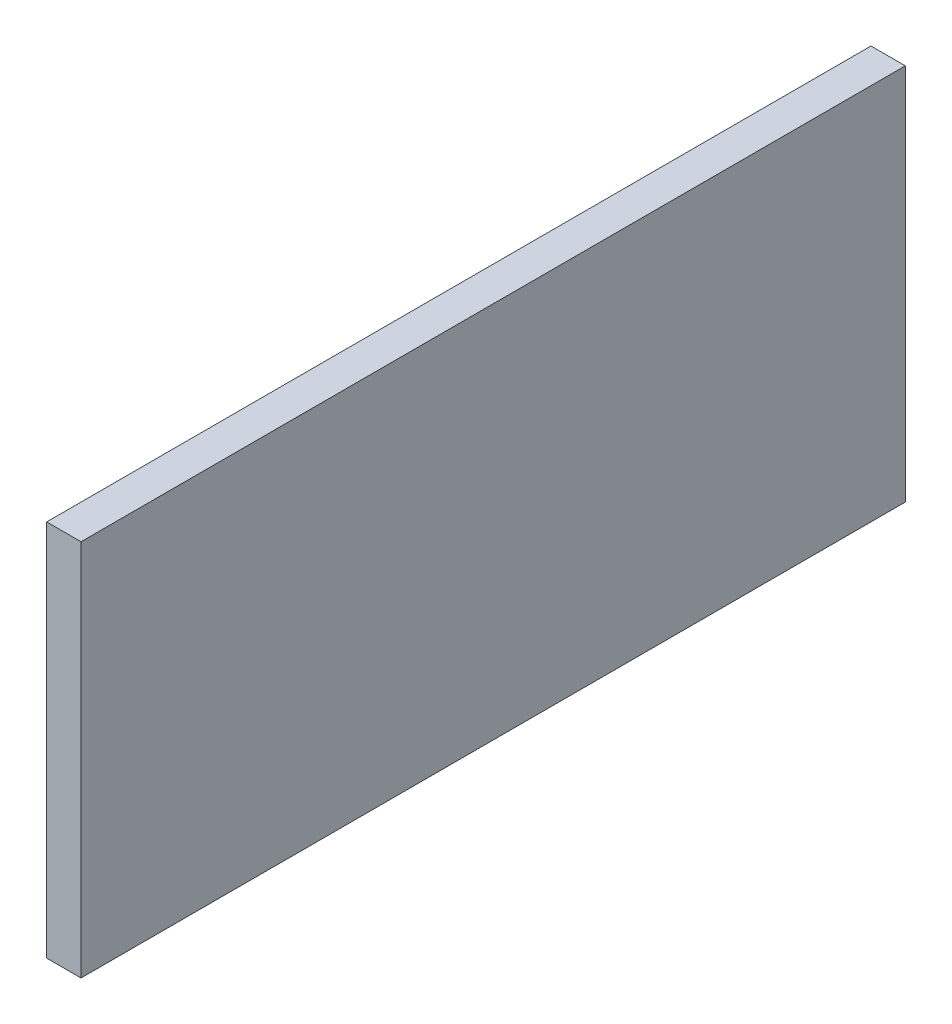
ISO-10303-21;
HEADER;
FILE_DESCRIPTION(('STEP AP214'),'2;1');
FILE_NAME('part.step','',(''),(''),'','','');
FILE_SCHEMA(('AUTOMOTIVE_DESIGN { 1 0 10303 214 1 1 1 1 }'));
ENDSEC;
DATA;
#1=APPLICATION_CONTEXT('core data for automotive mechanical design processes');
#2=APPLICATION_PROTOCOL_DEFINITION('international standard','automotive_design',2000,#1);
#3=PRODUCT_CONTEXT('',#1,'mechanical');
#4=PRODUCT('Part','Part','',(#3));
#5=PRODUCT_RELATED_PRODUCT_CATEGORY('part','',(#4));
#6=PRODUCT_DEFINITION_FORMATION('','',#4);
#7=PRODUCT_DEFINITION_CONTEXT('part definition',#1,'design');
#8=PRODUCT_DEFINITION('design','',#6,#7);
#9=PRODUCT_DEFINITION_SHAPE('','',#8);
#10=(LENGTH_UNIT() NAMED_UNIT(*) SI_UNIT(.MILLI.,.METRE.));
#11=(NAMED_UNIT(*) PLANE_ANGLE_UNIT() SI_UNIT($,.RADIAN.));
#12=(NAMED_UNIT(*) SI_UNIT($,.STERADIAN.) SOLID_ANGLE_UNIT());
#13=UNCERTAINTY_MEASURE_WITH_UNIT(LENGTH_MEASURE(1.E-05),#10,'distance_accuracy_value','');
#14=(GEOMETRIC_REPRESENTATION_CONTEXT(3) GLOBAL_UNCERTAINTY_ASSIGNED_CONTEXT((#13)) GLOBAL_UNIT_ASSIGNED_CONTEXT((#10,
#11,#12)) REPRESENTATION_CONTEXT('',''));
#15=CARTESIAN_POINT('',(0.,0.,0.));
#16=DIRECTION('',(0.,0.,1.));
#17=DIRECTION('',(1.,0.,0.));
#18=AXIS2_PLACEMENT_3D('',#15,#16,#17);
#19=CARTESIAN_POINT('',(12.7,69.85,-152.4));
#20=DIRECTION('',(0.,0.,1.));
#21=DIRECTION('',(1.,0.,0.));
#22=AXIS2_PLACEMENT_3D('',#19,#20,#21);
#23=PLANE('',#22);
#24=DIRECTION('',(0.,1.,0.));
#25=VECTOR('',#24,1.);
#26=CARTESIAN_POINT('',(0.,69.85,-152.4));
#27=LINE('',#26,#25);
#28=CARTESIAN_POINT('',(0.,-69.85,-152.4));
#29=VERTEX_POINT('',#28);
#30=CARTESIAN_POINT('',(0.,69.85,-152.4));
#31=VERTEX_POINT('',#30);
#32=EDGE_CURVE('E107',#29,#31,#27,.T.);
#33=ORIENTED_EDGE('',*,*,#32,.T.);
#34=DIRECTION('',(-1.,0.,0.));
#35=VECTOR('',#34,1.);
#36=CARTESIAN_POINT('',(12.7,69.85,-152.4));
#37=LINE('',#36,#35);
#38=CARTESIAN_POINT('',(12.7,69.85,-152.4));
#39=VERTEX_POINT('',#38);
#40=EDGE_CURVE('E11',#39,#31,#37,.T.);
#41=ORIENTED_EDGE('',*,*,#40,.F.);
#42=DIRECTION('',(0.,1.,0.));
#43=VECTOR('',#42,1.);
#44=CARTESIAN_POINT('',(12.7,69.85,-152.4));
#45=LINE('',#44,#43);
#46=CARTESIAN_POINT('',(12.7,-69.85,-152.4));
#47=VERTEX_POINT('',#46);
#48=EDGE_CURVE('E91',#47,#39,#45,.T.);
#49=ORIENTED_EDGE('',*,*,#48,.F.);
#50=DIRECTION('',(-1.,0.,0.));
#51=VECTOR('',#50,1.);
#52=CARTESIAN_POINT('',(12.7,-69.85,-152.4));
#53=LINE('',#52,#51);
#54=EDGE_CURVE('E103',#47,#29,#53,.T.);
#55=ORIENTED_EDGE('',*,*,#54,.T.);
#56=EDGE_LOOP('',(#33,#41,#49,#55));
#57=FACE_BOUND('',#56,.T.);
#58=ADVANCED_FACE('F39',(#57),#23,.F.);
#59=CARTESIAN_POINT('',(12.7,69.85,152.4));
#60=DIRECTION('',(0.,-1.,0.));
#61=DIRECTION('',(0.,0.,-1.));
#62=AXIS2_PLACEMENT_3D('',#59,#60,#61);
#63=PLANE('',#62);
#64=DIRECTION('',(0.,0.,1.));
#65=VECTOR('',#64,1.);
#66=CARTESIAN_POINT('',(0.,69.85,152.4));
#67=LINE('',#66,#65);
#68=CARTESIAN_POINT('',(0.,69.85,152.4));
#69=VERTEX_POINT('',#68);
#70=EDGE_CURVE('E96',#31,#69,#67,.T.);
#71=ORIENTED_EDGE('',*,*,#70,.T.);
#72=DIRECTION('',(-1.,0.,0.));
#73=VECTOR('',#72,1.);
#74=CARTESIAN_POINT('',(12.7,69.85,152.4));
#75=LINE('',#74,#73);
#76=CARTESIAN_POINT('',(12.7,69.85,152.4));
#77=VERTEX_POINT('',#76);
#78=EDGE_CURVE('E48',#77,#69,#75,.T.);
#79=ORIENTED_EDGE('',*,*,#78,.F.);
#80=DIRECTION('',(0.,0.,1.));
#81=VECTOR('',#80,1.);
#82=CARTESIAN_POINT('',(12.7,69.85,152.4));
#83=LINE('',#82,#81);
#84=EDGE_CURVE('E86',#39,#77,#83,.T.);
#85=ORIENTED_EDGE('',*,*,#84,.F.);
#86=ORIENTED_EDGE('',*,*,#40,.T.);
#87=EDGE_LOOP('',(#71,#79,#85,#86));
#88=FACE_BOUND('',#87,.T.);
#89=ADVANCED_FACE('F95',(#88),#63,.F.);
#90=CARTESIAN_POINT('',(12.7,69.85,152.4));
#91=DIRECTION('',(0.,0.,-1.));
#92=DIRECTION('',(-1.,0.,0.));
#93=AXIS2_PLACEMENT_3D('',#90,#91,#92);
#94=PLANE('',#93);
#95=DIRECTION('',(0.,-1.,0.));
#96=VECTOR('',#95,1.);
#97=CARTESIAN_POINT('',(0.,69.85,152.4));
#98=LINE('',#97,#96);
#99=CARTESIAN_POINT('',(0.,-69.85,152.4));
#100=VERTEX_POINT('',#99);
#101=EDGE_CURVE('E73',#69,#100,#98,.T.);
#102=ORIENTED_EDGE('',*,*,#101,.T.);
#103=DIRECTION('',(-1.,0.,0.));
#104=VECTOR('',#103,1.);
#105=CARTESIAN_POINT('',(12.7,-69.85,152.4));
#106=LINE('',#105,#104);
#107=CARTESIAN_POINT('',(12.7,-69.85,152.4));
#108=VERTEX_POINT('',#107);
#109=EDGE_CURVE('E98',#108,#100,#106,.T.);
#110=ORIENTED_EDGE('',*,*,#109,.F.);
#111=DIRECTION('',(0.,-1.,0.));
#112=VECTOR('',#111,1.);
#113=CARTESIAN_POINT('',(12.7,69.85,152.4));
#114=LINE('',#113,#112);
#115=EDGE_CURVE('E89',#77,#108,#114,.T.);
#116=ORIENTED_EDGE('',*,*,#115,.F.);
#117=ORIENTED_EDGE('',*,*,#78,.T.);
#118=EDGE_LOOP('',(#102,#110,#116,#117));
#119=FACE_BOUND('',#118,.T.);
#120=ADVANCED_FACE('F99',(#119),#94,.F.);
#121=CARTESIAN_POINT('',(12.7,-69.85,152.4));
#122=DIRECTION('',(0.,1.,0.));
#123=DIRECTION('',(0.,0.,1.));
#124=AXIS2_PLACEMENT_3D('',#121,#122,#123);
#125=PLANE('',#124);
#126=DIRECTION('',(0.,0.,-1.));
#127=VECTOR('',#126,1.);
#128=CARTESIAN_POINT('',(0.,-69.85,152.4));
#129=LINE('',#128,#127);
#130=EDGE_CURVE('E79',#100,#29,#129,.T.);
#131=ORIENTED_EDGE('',*,*,#130,.T.);
#132=ORIENTED_EDGE('',*,*,#54,.F.);
#133=DIRECTION('',(0.,0.,-1.));
#134=VECTOR('',#133,1.);
#135=CARTESIAN_POINT('',(12.7,-69.85,152.4));
#136=LINE('',#135,#134);
#137=EDGE_CURVE('E56',#108,#47,#136,.T.);
#138=ORIENTED_EDGE('',*,*,#137,.F.);
#139=ORIENTED_EDGE('',*,*,#109,.T.);
#140=EDGE_LOOP('',(#131,#132,#138,#139));
#141=FACE_BOUND('',#140,.T.);
#142=ADVANCED_FACE('F120',(#141),#125,.F.);
#143=CARTESIAN_POINT('',(12.7,0.,0.));
#144=DIRECTION('',(1.,0.,0.));
#145=DIRECTION('',(0.,0.,-1.));
#146=AXIS2_PLACEMENT_3D('',#143,#144,#145);
#147=PLANE('',#146);
#148=ORIENTED_EDGE('',*,*,#48,.T.);
#149=ORIENTED_EDGE('',*,*,#84,.T.);
#150=ORIENTED_EDGE('',*,*,#115,.T.);
#151=ORIENTED_EDGE('',*,*,#137,.T.);
#152=EDGE_LOOP('',(#148,#149,#150,#151));
#153=FACE_BOUND('',#152,.T.);
#154=ADVANCED_FACE('F87',(#153),#147,.T.);
#155=CARTESIAN_POINT('',(0.,0.,0.));
#156=DIRECTION('',(1.,0.,0.));
#157=DIRECTION('',(0.,0.,-1.));
#158=AXIS2_PLACEMENT_3D('',#155,#156,#157);
#159=PLANE('',#158);
#160=ORIENTED_EDGE('',*,*,#32,.F.);
#161=ORIENTED_EDGE('',*,*,#130,.F.);
#162=ORIENTED_EDGE('',*,*,#101,.F.);
#163=ORIENTED_EDGE('',*,*,#70,.F.);
#164=EDGE_LOOP('',(#160,#161,#162,#163));
#165=FACE_BOUND('',#164,.T.);
#166=ADVANCED_FACE('F123',(#165),#159,.F.);
#167=CLOSED_SHELL('',(#58,#89,#120,#142,#154,#166));
#168=MANIFOLD_SOLID_BREP('B2',#167);
#169=ADVANCED_BREP_SHAPE_REPRESENTATION('',(#18,#168),#14);
#170=SHAPE_DEFINITION_REPRESENTATION(#9,#169);
ENDSEC;
END-ISO-10303-21;
